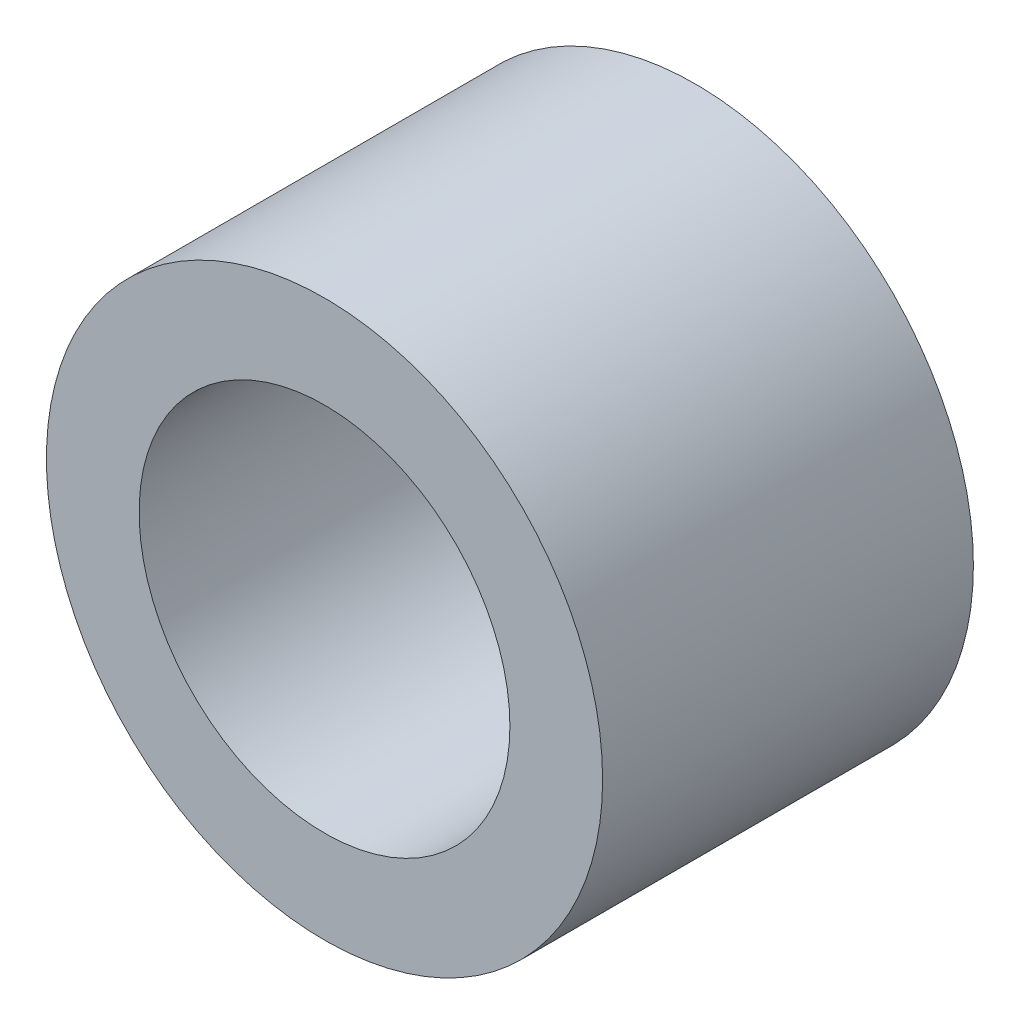
ISO-10303-21;
HEADER;
FILE_DESCRIPTION(('STEP AP214'),'2;1');
FILE_NAME('part.step','',(''),(''),'','','');
FILE_SCHEMA(('AUTOMOTIVE_DESIGN { 1 0 10303 214 1 1 1 1 }'));
ENDSEC;
DATA;
#1=APPLICATION_CONTEXT('core data for automotive mechanical design processes');
#2=APPLICATION_PROTOCOL_DEFINITION('international standard','automotive_design',2000,#1);
#3=PRODUCT_CONTEXT('',#1,'mechanical');
#4=PRODUCT('Part','Part','',(#3));
#5=PRODUCT_RELATED_PRODUCT_CATEGORY('part','',(#4));
#6=PRODUCT_DEFINITION_FORMATION('','',#4);
#7=PRODUCT_DEFINITION_CONTEXT('part definition',#1,'design');
#8=PRODUCT_DEFINITION('design','',#6,#7);
#9=PRODUCT_DEFINITION_SHAPE('','',#8);
#10=(LENGTH_UNIT() NAMED_UNIT(*) SI_UNIT(.MILLI.,.METRE.));
#11=(NAMED_UNIT(*) PLANE_ANGLE_UNIT() SI_UNIT($,.RADIAN.));
#12=(NAMED_UNIT(*) SI_UNIT($,.STERADIAN.) SOLID_ANGLE_UNIT());
#13=UNCERTAINTY_MEASURE_WITH_UNIT(LENGTH_MEASURE(1.E-05),#10,'distance_accuracy_value','');
#14=(GEOMETRIC_REPRESENTATION_CONTEXT(3) GLOBAL_UNCERTAINTY_ASSIGNED_CONTEXT((#13)) GLOBAL_UNIT_ASSIGNED_CONTEXT((#10,
#11,#12)) REPRESENTATION_CONTEXT('',''));
#15=CARTESIAN_POINT('',(0.,0.,0.));
#16=DIRECTION('',(0.,0.,1.));
#17=DIRECTION('',(1.,0.,0.));
#18=AXIS2_PLACEMENT_3D('',#15,#16,#17);
#19=CARTESIAN_POINT('',(0.,0.,6.35));
#20=DIRECTION('',(0.,0.,1.));
#21=DIRECTION('',(1.,0.,0.));
#22=AXIS2_PLACEMENT_3D('',#19,#20,#21);
#23=PLANE('',#22);
#24=CARTESIAN_POINT('',(0.,0.,6.35));
#25=DIRECTION('',(0.,0.,1.));
#26=DIRECTION('',(1.,0.,0.));
#27=AXIS2_PLACEMENT_3D('',#24,#25,#26);
#28=CIRCLE('',#27,4.7625);
#29=CARTESIAN_POINT('',(4.7625,0.,6.35));
#30=VERTEX_POINT('',#29);
#31=EDGE_CURVE('E10',#30,#30,#28,.T.);
#32=ORIENTED_EDGE('',*,*,#31,.T.);
#33=EDGE_LOOP('',(#32));
#34=FACE_BOUND('',#33,.T.);
#35=CARTESIAN_POINT('',(0.,0.,6.35));
#36=DIRECTION('',(0.,0.,1.));
#37=DIRECTION('',(1.,0.,0.));
#38=AXIS2_PLACEMENT_3D('',#35,#36,#37);
#39=CIRCLE('',#38,3.175);
#40=CARTESIAN_POINT('',(3.175,0.,6.35));
#41=VERTEX_POINT('',#40);
#42=EDGE_CURVE('E41',#41,#41,#39,.T.);
#43=ORIENTED_EDGE('',*,*,#42,.F.);
#44=EDGE_LOOP('',(#43));
#45=FACE_BOUND('',#44,.T.);
#46=ADVANCED_FACE('F30',(#34,#45),#23,.T.);
#47=CARTESIAN_POINT('',(0.,0.,0.));
#48=DIRECTION('',(0.,0.,1.));
#49=DIRECTION('',(1.,0.,0.));
#50=AXIS2_PLACEMENT_3D('',#47,#48,#49);
#51=PLANE('',#50);
#52=CARTESIAN_POINT('',(0.,0.,0.));
#53=DIRECTION('',(0.,0.,1.));
#54=DIRECTION('',(1.,0.,0.));
#55=AXIS2_PLACEMENT_3D('',#52,#53,#54);
#56=CIRCLE('',#55,4.7625);
#57=CARTESIAN_POINT('',(4.7625,0.,0.));
#58=VERTEX_POINT('',#57);
#59=EDGE_CURVE('E34',#58,#58,#56,.T.);
#60=ORIENTED_EDGE('',*,*,#59,.F.);
#61=EDGE_LOOP('',(#60));
#62=FACE_BOUND('',#61,.T.);
#63=CARTESIAN_POINT('',(0.,0.,0.));
#64=DIRECTION('',(0.,0.,1.));
#65=DIRECTION('',(1.,0.,0.));
#66=AXIS2_PLACEMENT_3D('',#63,#64,#65);
#67=CIRCLE('',#66,3.175);
#68=CARTESIAN_POINT('',(3.175,0.,0.));
#69=VERTEX_POINT('',#68);
#70=EDGE_CURVE('E43',#69,#69,#67,.T.);
#71=ORIENTED_EDGE('',*,*,#70,.T.);
#72=EDGE_LOOP('',(#71));
#73=FACE_BOUND('',#72,.T.);
#74=ADVANCED_FACE('F53',(#62,#73),#51,.F.);
#75=CARTESIAN_POINT('',(0.,0.,6.35));
#76=DIRECTION('',(0.,0.,-1.));
#77=DIRECTION('',(-1.,0.,0.));
#78=AXIS2_PLACEMENT_3D('',#75,#76,#77);
#79=CYLINDRICAL_SURFACE('',#78,4.7625);
#80=ORIENTED_EDGE('',*,*,#31,.F.);
#81=EDGE_LOOP('',(#80));
#82=FACE_BOUND('',#81,.T.);
#83=ORIENTED_EDGE('',*,*,#59,.T.);
#84=EDGE_LOOP('',(#83));
#85=FACE_BOUND('',#84,.T.);
#86=ADVANCED_FACE('F32',(#82,#85),#79,.T.);
#87=CARTESIAN_POINT('',(0.,0.,6.35));
#88=DIRECTION('',(0.,0.,-1.));
#89=DIRECTION('',(-1.,0.,0.));
#90=AXIS2_PLACEMENT_3D('',#87,#88,#89);
#91=CYLINDRICAL_SURFACE('',#90,3.175);
#92=ORIENTED_EDGE('',*,*,#42,.T.);
#93=EDGE_LOOP('',(#92));
#94=FACE_BOUND('',#93,.T.);
#95=ORIENTED_EDGE('',*,*,#70,.F.);
#96=EDGE_LOOP('',(#95));
#97=FACE_BOUND('',#96,.T.);
#98=ADVANCED_FACE('F49',(#94,#97),#91,.F.);
#99=CLOSED_SHELL('',(#46,#74,#86,#98));
#100=MANIFOLD_SOLID_BREP('B2',#99);
#101=ADVANCED_BREP_SHAPE_REPRESENTATION('',(#18,#100),#14);
#102=SHAPE_DEFINITION_REPRESENTATION(#9,#101);
ENDSEC;
END-ISO-10303-21;
